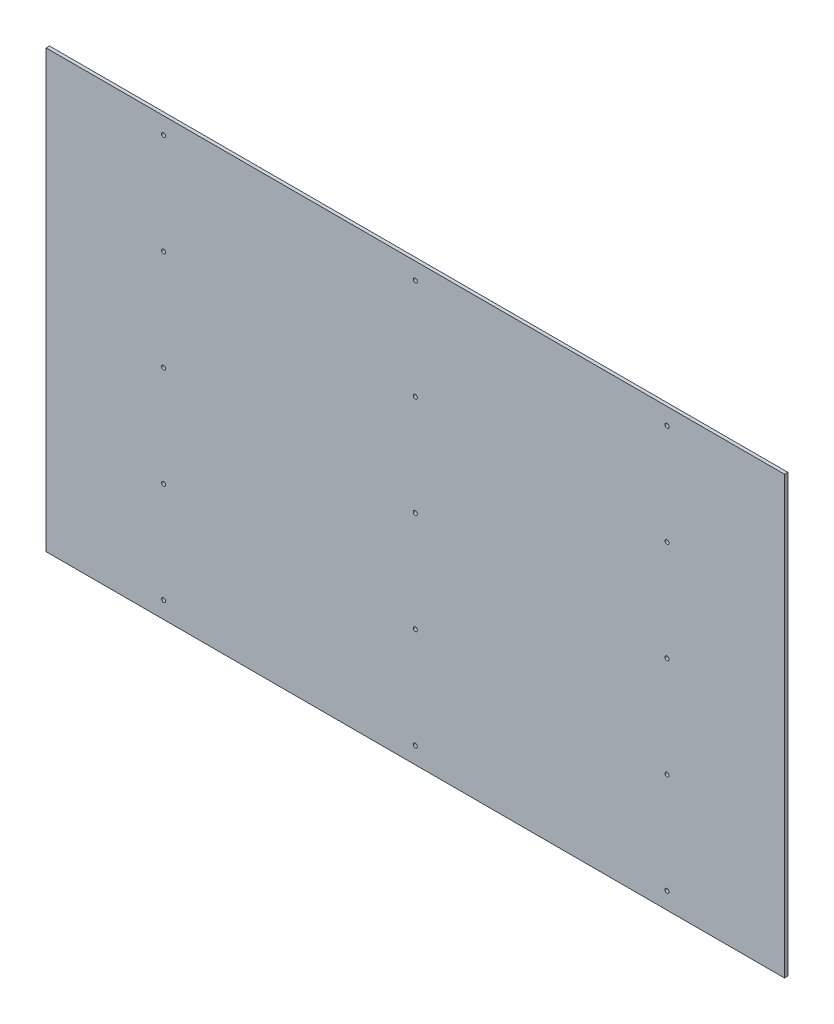
ISO-10303-21;
HEADER;
FILE_DESCRIPTION(('STEP AP214'),'2;1');
FILE_NAME('part.step','',(''),(''),'','','');
FILE_SCHEMA(('AUTOMOTIVE_DESIGN { 1 0 10303 214 1 1 1 1 }'));
ENDSEC;
DATA;
#1=APPLICATION_CONTEXT('core data for automotive mechanical design processes');
#2=APPLICATION_PROTOCOL_DEFINITION('international standard','automotive_design',2000,#1);
#3=PRODUCT_CONTEXT('',#1,'mechanical');
#4=PRODUCT('Part','Part','',(#3));
#5=PRODUCT_RELATED_PRODUCT_CATEGORY('part','',(#4));
#6=PRODUCT_DEFINITION_FORMATION('','',#4);
#7=PRODUCT_DEFINITION_CONTEXT('part definition',#1,'design');
#8=PRODUCT_DEFINITION('design','',#6,#7);
#9=PRODUCT_DEFINITION_SHAPE('','',#8);
#10=(LENGTH_UNIT() NAMED_UNIT(*) SI_UNIT(.MILLI.,.METRE.));
#11=(NAMED_UNIT(*) PLANE_ANGLE_UNIT() SI_UNIT($,.RADIAN.));
#12=(NAMED_UNIT(*) SI_UNIT($,.STERADIAN.) SOLID_ANGLE_UNIT());
#13=UNCERTAINTY_MEASURE_WITH_UNIT(LENGTH_MEASURE(1.E-05),#10,'distance_accuracy_value','');
#14=(GEOMETRIC_REPRESENTATION_CONTEXT(3) GLOBAL_UNCERTAINTY_ASSIGNED_CONTEXT((#13)) GLOBAL_UNIT_ASSIGNED_CONTEXT((#10,
#11,#12)) REPRESENTATION_CONTEXT('',''));
#15=CARTESIAN_POINT('',(0.,0.,0.));
#16=DIRECTION('',(0.,0.,1.));
#17=DIRECTION('',(1.,0.,0.));
#18=AXIS2_PLACEMENT_3D('',#15,#16,#17);
#19=CARTESIAN_POINT('',(750.,600.,10.));
#20=DIRECTION('',(0.,0.,1.));
#21=DIRECTION('',(1.,0.,0.));
#22=AXIS2_PLACEMENT_3D('',#19,#20,#21);
#23=CYLINDRICAL_SURFACE('',#22,6.00000000000001);
#24=CARTESIAN_POINT('',(750.,600.,0.));
#25=DIRECTION('',(0.,0.,1.));
#26=DIRECTION('',(1.,0.,0.));
#27=AXIS2_PLACEMENT_3D('',#24,#25,#26);
#28=CIRCLE('',#27,6.00000000000001);
#29=CARTESIAN_POINT('',(756.,600.,0.));
#30=VERTEX_POINT('',#29);
#31=EDGE_CURVE('E45',#30,#30,#28,.T.);
#32=ORIENTED_EDGE('',*,*,#31,.F.);
#33=EDGE_LOOP('',(#32));
#34=FACE_BOUND('',#33,.T.);
#35=CARTESIAN_POINT('',(750.,600.,10.));
#36=DIRECTION('',(0.,0.,1.));
#37=DIRECTION('',(1.,0.,0.));
#38=AXIS2_PLACEMENT_3D('',#35,#36,#37);
#39=CIRCLE('',#38,6.00000000000001);
#40=CARTESIAN_POINT('',(756.,600.,10.));
#41=VERTEX_POINT('',#40);
#42=EDGE_CURVE('E11',#41,#41,#39,.T.);
#43=ORIENTED_EDGE('',*,*,#42,.T.);
#44=EDGE_LOOP('',(#43));
#45=FACE_BOUND('',#44,.T.);
#46=ADVANCED_FACE('F37',(#34,#45),#23,.F.);
#47=CARTESIAN_POINT('',(750.,300.,10.));
#48=DIRECTION('',(0.,0.,1.));
#49=DIRECTION('',(1.,0.,0.));
#50=AXIS2_PLACEMENT_3D('',#47,#48,#49);
#51=CYLINDRICAL_SURFACE('',#50,6.00000000000001);
#52=CARTESIAN_POINT('',(750.,300.,0.));
#53=DIRECTION('',(0.,0.,1.));
#54=DIRECTION('',(1.,0.,0.));
#55=AXIS2_PLACEMENT_3D('',#52,#53,#54);
#56=CIRCLE('',#55,6.00000000000001);
#57=CARTESIAN_POINT('',(756.,300.,0.));
#58=VERTEX_POINT('',#57);
#59=EDGE_CURVE('E175',#58,#58,#56,.T.);
#60=ORIENTED_EDGE('',*,*,#59,.F.);
#61=EDGE_LOOP('',(#60));
#62=FACE_BOUND('',#61,.T.);
#63=CARTESIAN_POINT('',(750.,300.,10.));
#64=DIRECTION('',(0.,0.,1.));
#65=DIRECTION('',(1.,0.,0.));
#66=AXIS2_PLACEMENT_3D('',#63,#64,#65);
#67=CIRCLE('',#66,6.00000000000001);
#68=CARTESIAN_POINT('',(756.,300.,10.));
#69=VERTEX_POINT('',#68);
#70=EDGE_CURVE('E178',#69,#69,#67,.T.);
#71=ORIENTED_EDGE('',*,*,#70,.T.);
#72=EDGE_LOOP('',(#71));
#73=FACE_BOUND('',#72,.T.);
#74=ADVANCED_FACE('F187',(#62,#73),#51,.F.);
#75=CARTESIAN_POINT('',(750.,0.,10.));
#76=DIRECTION('',(0.,0.,1.));
#77=DIRECTION('',(1.,0.,0.));
#78=AXIS2_PLACEMENT_3D('',#75,#76,#77);
#79=CYLINDRICAL_SURFACE('',#78,6.00000000000001);
#80=CARTESIAN_POINT('',(750.,0.,0.));
#81=DIRECTION('',(0.,0.,1.));
#82=DIRECTION('',(1.,0.,0.));
#83=AXIS2_PLACEMENT_3D('',#80,#81,#82);
#84=CIRCLE('',#83,6.00000000000001);
#85=CARTESIAN_POINT('',(756.,0.,0.));
#86=VERTEX_POINT('',#85);
#87=EDGE_CURVE('E169',#86,#86,#84,.T.);
#88=ORIENTED_EDGE('',*,*,#87,.F.);
#89=EDGE_LOOP('',(#88));
#90=FACE_BOUND('',#89,.T.);
#91=CARTESIAN_POINT('',(750.,0.,10.));
#92=DIRECTION('',(0.,0.,1.));
#93=DIRECTION('',(1.,0.,0.));
#94=AXIS2_PLACEMENT_3D('',#91,#92,#93);
#95=CIRCLE('',#94,6.00000000000001);
#96=CARTESIAN_POINT('',(756.,0.,10.));
#97=VERTEX_POINT('',#96);
#98=EDGE_CURVE('E172',#97,#97,#95,.T.);
#99=ORIENTED_EDGE('',*,*,#98,.T.);
#100=EDGE_LOOP('',(#99));
#101=FACE_BOUND('',#100,.T.);
#102=ADVANCED_FACE('F250',(#90,#101),#79,.F.);
#103=CARTESIAN_POINT('',(750.,-300.,10.));
#104=DIRECTION('',(0.,0.,1.));
#105=DIRECTION('',(1.,0.,0.));
#106=AXIS2_PLACEMENT_3D('',#103,#104,#105);
#107=CYLINDRICAL_SURFACE('',#106,6.00000000000001);
#108=CARTESIAN_POINT('',(750.,-300.,0.));
#109=DIRECTION('',(0.,0.,1.));
#110=DIRECTION('',(1.,0.,0.));
#111=AXIS2_PLACEMENT_3D('',#108,#109,#110);
#112=CIRCLE('',#111,6.00000000000001);
#113=CARTESIAN_POINT('',(756.,-300.,0.));
#114=VERTEX_POINT('',#113);
#115=EDGE_CURVE('E163',#114,#114,#112,.T.);
#116=ORIENTED_EDGE('',*,*,#115,.F.);
#117=EDGE_LOOP('',(#116));
#118=FACE_BOUND('',#117,.T.);
#119=CARTESIAN_POINT('',(750.,-300.,10.));
#120=DIRECTION('',(0.,0.,1.));
#121=DIRECTION('',(1.,0.,0.));
#122=AXIS2_PLACEMENT_3D('',#119,#120,#121);
#123=CIRCLE('',#122,6.00000000000001);
#124=CARTESIAN_POINT('',(756.,-300.,10.));
#125=VERTEX_POINT('',#124);
#126=EDGE_CURVE('E166',#125,#125,#123,.T.);
#127=ORIENTED_EDGE('',*,*,#126,.T.);
#128=EDGE_LOOP('',(#127));
#129=FACE_BOUND('',#128,.T.);
#130=ADVANCED_FACE('F246',(#118,#129),#107,.F.);
#131=CARTESIAN_POINT('',(750.,-600.,10.));
#132=DIRECTION('',(0.,0.,1.));
#133=DIRECTION('',(1.,0.,0.));
#134=AXIS2_PLACEMENT_3D('',#131,#132,#133);
#135=CYLINDRICAL_SURFACE('',#134,6.00000000000001);
#136=CARTESIAN_POINT('',(750.,-600.,0.));
#137=DIRECTION('',(0.,0.,1.));
#138=DIRECTION('',(1.,0.,0.));
#139=AXIS2_PLACEMENT_3D('',#136,#137,#138);
#140=CIRCLE('',#139,6.00000000000001);
#141=CARTESIAN_POINT('',(756.,-600.,0.));
#142=VERTEX_POINT('',#141);
#143=EDGE_CURVE('E157',#142,#142,#140,.T.);
#144=ORIENTED_EDGE('',*,*,#143,.F.);
#145=EDGE_LOOP('',(#144));
#146=FACE_BOUND('',#145,.T.);
#147=CARTESIAN_POINT('',(750.,-600.,10.));
#148=DIRECTION('',(0.,0.,1.));
#149=DIRECTION('',(1.,0.,0.));
#150=AXIS2_PLACEMENT_3D('',#147,#148,#149);
#151=CIRCLE('',#150,6.00000000000001);
#152=CARTESIAN_POINT('',(756.,-600.,10.));
#153=VERTEX_POINT('',#152);
#154=EDGE_CURVE('E160',#153,#153,#151,.T.);
#155=ORIENTED_EDGE('',*,*,#154,.T.);
#156=EDGE_LOOP('',(#155));
#157=FACE_BOUND('',#156,.T.);
#158=ADVANCED_FACE('F242',(#146,#157),#135,.F.);
#159=CARTESIAN_POINT('',(0.,600.,10.));
#160=DIRECTION('',(0.,0.,1.));
#161=DIRECTION('',(1.,0.,0.));
#162=AXIS2_PLACEMENT_3D('',#159,#160,#161);
#163=CYLINDRICAL_SURFACE('',#162,6.00000000000001);
#164=CARTESIAN_POINT('',(0.,600.,0.));
#165=DIRECTION('',(0.,0.,1.));
#166=DIRECTION('',(1.,0.,0.));
#167=AXIS2_PLACEMENT_3D('',#164,#165,#166);
#168=CIRCLE('',#167,6.00000000000001);
#169=CARTESIAN_POINT('',(6.00000000000001,600.,0.));
#170=VERTEX_POINT('',#169);
#171=EDGE_CURVE('E151',#170,#170,#168,.T.);
#172=ORIENTED_EDGE('',*,*,#171,.F.);
#173=EDGE_LOOP('',(#172));
#174=FACE_BOUND('',#173,.T.);
#175=CARTESIAN_POINT('',(0.,600.,10.));
#176=DIRECTION('',(0.,0.,1.));
#177=DIRECTION('',(1.,0.,0.));
#178=AXIS2_PLACEMENT_3D('',#175,#176,#177);
#179=CIRCLE('',#178,6.00000000000001);
#180=CARTESIAN_POINT('',(6.00000000000001,600.,10.));
#181=VERTEX_POINT('',#180);
#182=EDGE_CURVE('E154',#181,#181,#179,.T.);
#183=ORIENTED_EDGE('',*,*,#182,.T.);
#184=EDGE_LOOP('',(#183));
#185=FACE_BOUND('',#184,.T.);
#186=ADVANCED_FACE('F238',(#174,#185),#163,.F.);
#187=CARTESIAN_POINT('',(0.,-600.,10.));
#188=DIRECTION('',(0.,0.,1.));
#189=DIRECTION('',(1.,0.,0.));
#190=AXIS2_PLACEMENT_3D('',#187,#188,#189);
#191=CYLINDRICAL_SURFACE('',#190,6.00000000000001);
#192=CARTESIAN_POINT('',(0.,-600.,0.));
#193=DIRECTION('',(0.,0.,1.));
#194=DIRECTION('',(1.,0.,0.));
#195=AXIS2_PLACEMENT_3D('',#192,#193,#194);
#196=CIRCLE('',#195,6.00000000000001);
#197=CARTESIAN_POINT('',(6.00000000000001,-600.,0.));
#198=VERTEX_POINT('',#197);
#199=EDGE_CURVE('E145',#198,#198,#196,.T.);
#200=ORIENTED_EDGE('',*,*,#199,.F.);
#201=EDGE_LOOP('',(#200));
#202=FACE_BOUND('',#201,.T.);
#203=CARTESIAN_POINT('',(0.,-600.,10.));
#204=DIRECTION('',(0.,0.,1.));
#205=DIRECTION('',(1.,0.,0.));
#206=AXIS2_PLACEMENT_3D('',#203,#204,#205);
#207=CIRCLE('',#206,6.00000000000001);
#208=CARTESIAN_POINT('',(6.00000000000001,-600.,10.));
#209=VERTEX_POINT('',#208);
#210=EDGE_CURVE('E148',#209,#209,#207,.T.);
#211=ORIENTED_EDGE('',*,*,#210,.T.);
#212=EDGE_LOOP('',(#211));
#213=FACE_BOUND('',#212,.T.);
#214=ADVANCED_FACE('F234',(#202,#213),#191,.F.);
#215=CARTESIAN_POINT('',(-750.,600.,10.));
#216=DIRECTION('',(0.,0.,1.));
#217=DIRECTION('',(1.,0.,0.));
#218=AXIS2_PLACEMENT_3D('',#215,#216,#217);
#219=CYLINDRICAL_SURFACE('',#218,6.00000000000001);
#220=CARTESIAN_POINT('',(-750.,600.,0.));
#221=DIRECTION('',(0.,0.,1.));
#222=DIRECTION('',(1.,0.,0.));
#223=AXIS2_PLACEMENT_3D('',#220,#221,#222);
#224=CIRCLE('',#223,6.00000000000001);
#225=CARTESIAN_POINT('',(-744.,600.,0.));
#226=VERTEX_POINT('',#225);
#227=EDGE_CURVE('E139',#226,#226,#224,.T.);
#228=ORIENTED_EDGE('',*,*,#227,.F.);
#229=EDGE_LOOP('',(#228));
#230=FACE_BOUND('',#229,.T.);
#231=CARTESIAN_POINT('',(-750.,600.,10.));
#232=DIRECTION('',(0.,0.,1.));
#233=DIRECTION('',(1.,0.,0.));
#234=AXIS2_PLACEMENT_3D('',#231,#232,#233);
#235=CIRCLE('',#234,6.00000000000001);
#236=CARTESIAN_POINT('',(-744.,600.,10.));
#237=VERTEX_POINT('',#236);
#238=EDGE_CURVE('E142',#237,#237,#235,.T.);
#239=ORIENTED_EDGE('',*,*,#238,.T.);
#240=EDGE_LOOP('',(#239));
#241=FACE_BOUND('',#240,.T.);
#242=ADVANCED_FACE('F230',(#230,#241),#219,.F.);
#243=CARTESIAN_POINT('',(-750.,300.,10.));
#244=DIRECTION('',(0.,0.,1.));
#245=DIRECTION('',(1.,0.,0.));
#246=AXIS2_PLACEMENT_3D('',#243,#244,#245);
#247=CYLINDRICAL_SURFACE('',#246,6.00000000000001);
#248=CARTESIAN_POINT('',(-750.,300.,0.));
#249=DIRECTION('',(0.,0.,1.));
#250=DIRECTION('',(1.,0.,0.));
#251=AXIS2_PLACEMENT_3D('',#248,#249,#250);
#252=CIRCLE('',#251,6.00000000000001);
#253=CARTESIAN_POINT('',(-744.,300.,0.));
#254=VERTEX_POINT('',#253);
#255=EDGE_CURVE('E133',#254,#254,#252,.T.);
#256=ORIENTED_EDGE('',*,*,#255,.F.);
#257=EDGE_LOOP('',(#256));
#258=FACE_BOUND('',#257,.T.);
#259=CARTESIAN_POINT('',(-750.,300.,10.));
#260=DIRECTION('',(0.,0.,1.));
#261=DIRECTION('',(1.,0.,0.));
#262=AXIS2_PLACEMENT_3D('',#259,#260,#261);
#263=CIRCLE('',#262,6.00000000000001);
#264=CARTESIAN_POINT('',(-744.,300.,10.));
#265=VERTEX_POINT('',#264);
#266=EDGE_CURVE('E136',#265,#265,#263,.T.);
#267=ORIENTED_EDGE('',*,*,#266,.T.);
#268=EDGE_LOOP('',(#267));
#269=FACE_BOUND('',#268,.T.);
#270=ADVANCED_FACE('F226',(#258,#269),#247,.F.);
#271=CARTESIAN_POINT('',(-750.,0.,10.));
#272=DIRECTION('',(0.,0.,1.));
#273=DIRECTION('',(1.,0.,0.));
#274=AXIS2_PLACEMENT_3D('',#271,#272,#273);
#275=CYLINDRICAL_SURFACE('',#274,6.00000000000001);
#276=CARTESIAN_POINT('',(-750.,0.,0.));
#277=DIRECTION('',(0.,0.,1.));
#278=DIRECTION('',(1.,0.,0.));
#279=AXIS2_PLACEMENT_3D('',#276,#277,#278);
#280=CIRCLE('',#279,6.00000000000001);
#281=CARTESIAN_POINT('',(-744.,0.,0.));
#282=VERTEX_POINT('',#281);
#283=EDGE_CURVE('E127',#282,#282,#280,.T.);
#284=ORIENTED_EDGE('',*,*,#283,.F.);
#285=EDGE_LOOP('',(#284));
#286=FACE_BOUND('',#285,.T.);
#287=CARTESIAN_POINT('',(-750.,0.,10.));
#288=DIRECTION('',(0.,0.,1.));
#289=DIRECTION('',(1.,0.,0.));
#290=AXIS2_PLACEMENT_3D('',#287,#288,#289);
#291=CIRCLE('',#290,6.00000000000001);
#292=CARTESIAN_POINT('',(-744.,0.,10.));
#293=VERTEX_POINT('',#292);
#294=EDGE_CURVE('E130',#293,#293,#291,.T.);
#295=ORIENTED_EDGE('',*,*,#294,.T.);
#296=EDGE_LOOP('',(#295));
#297=FACE_BOUND('',#296,.T.);
#298=ADVANCED_FACE('F222',(#286,#297),#275,.F.);
#299=CARTESIAN_POINT('',(0.,300.,10.));
#300=DIRECTION('',(0.,0.,1.));
#301=DIRECTION('',(1.,0.,0.));
#302=AXIS2_PLACEMENT_3D('',#299,#300,#301);
#303=CYLINDRICAL_SURFACE('',#302,6.00000000000001);
#304=CARTESIAN_POINT('',(0.,300.,0.));
#305=DIRECTION('',(0.,0.,1.));
#306=DIRECTION('',(1.,0.,0.));
#307=AXIS2_PLACEMENT_3D('',#304,#305,#306);
#308=CIRCLE('',#307,6.00000000000001);
#309=CARTESIAN_POINT('',(6.00000000000001,300.,0.));
#310=VERTEX_POINT('',#309);
#311=EDGE_CURVE('E121',#310,#310,#308,.T.);
#312=ORIENTED_EDGE('',*,*,#311,.F.);
#313=EDGE_LOOP('',(#312));
#314=FACE_BOUND('',#313,.T.);
#315=CARTESIAN_POINT('',(0.,300.,10.));
#316=DIRECTION('',(0.,0.,1.));
#317=DIRECTION('',(1.,0.,0.));
#318=AXIS2_PLACEMENT_3D('',#315,#316,#317);
#319=CIRCLE('',#318,6.00000000000001);
#320=CARTESIAN_POINT('',(6.00000000000001,300.,10.));
#321=VERTEX_POINT('',#320);
#322=EDGE_CURVE('E124',#321,#321,#319,.T.);
#323=ORIENTED_EDGE('',*,*,#322,.T.);
#324=EDGE_LOOP('',(#323));
#325=FACE_BOUND('',#324,.T.);
#326=ADVANCED_FACE('F218',(#314,#325),#303,.F.);
#327=CARTESIAN_POINT('',(0.,0.,10.));
#328=DIRECTION('',(0.,0.,1.));
#329=DIRECTION('',(1.,0.,0.));
#330=AXIS2_PLACEMENT_3D('',#327,#328,#329);
#331=CYLINDRICAL_SURFACE('',#330,6.00000000000001);
#332=CARTESIAN_POINT('',(0.,0.,0.));
#333=DIRECTION('',(0.,0.,1.));
#334=DIRECTION('',(1.,0.,0.));
#335=AXIS2_PLACEMENT_3D('',#332,#333,#334);
#336=CIRCLE('',#335,6.00000000000001);
#337=CARTESIAN_POINT('',(6.00000000000001,0.,0.));
#338=VERTEX_POINT('',#337);
#339=EDGE_CURVE('E115',#338,#338,#336,.T.);
#340=ORIENTED_EDGE('',*,*,#339,.F.);
#341=EDGE_LOOP('',(#340));
#342=FACE_BOUND('',#341,.T.);
#343=CARTESIAN_POINT('',(0.,0.,10.));
#344=DIRECTION('',(0.,0.,1.));
#345=DIRECTION('',(1.,0.,0.));
#346=AXIS2_PLACEMENT_3D('',#343,#344,#345);
#347=CIRCLE('',#346,6.00000000000001);
#348=CARTESIAN_POINT('',(6.00000000000001,0.,10.));
#349=VERTEX_POINT('',#348);
#350=EDGE_CURVE('E118',#349,#349,#347,.T.);
#351=ORIENTED_EDGE('',*,*,#350,.T.);
#352=EDGE_LOOP('',(#351));
#353=FACE_BOUND('',#352,.T.);
#354=ADVANCED_FACE('F214',(#342,#353),#331,.F.);
#355=CARTESIAN_POINT('',(1100.,-650.,10.));
#356=DIRECTION('',(-1.,0.,0.));
#357=DIRECTION('',(0.,0.,1.));
#358=AXIS2_PLACEMENT_3D('',#355,#356,#357);
#359=PLANE('',#358);
#360=DIRECTION('',(0.,1.,0.));
#361=VECTOR('',#360,1.);
#362=CARTESIAN_POINT('',(1100.,-650.,0.));
#363=LINE('',#362,#361);
#364=CARTESIAN_POINT('',(1100.,-650.,0.));
#365=VERTEX_POINT('',#364);
#366=CARTESIAN_POINT('',(1100.,650.,0.));
#367=VERTEX_POINT('',#366);
#368=EDGE_CURVE('E105',#365,#367,#363,.T.);
#369=ORIENTED_EDGE('',*,*,#368,.T.);
#370=DIRECTION('',(0.,0.,-1.));
#371=VECTOR('',#370,1.);
#372=CARTESIAN_POINT('',(1100.,650.,10.));
#373=LINE('',#372,#371);
#374=CARTESIAN_POINT('',(1100.,650.,10.));
#375=VERTEX_POINT('',#374);
#376=EDGE_CURVE('E96',#375,#367,#373,.T.);
#377=ORIENTED_EDGE('',*,*,#376,.F.);
#378=DIRECTION('',(0.,1.,0.));
#379=VECTOR('',#378,1.);
#380=CARTESIAN_POINT('',(1100.,-650.,10.));
#381=LINE('',#380,#379);
#382=CARTESIAN_POINT('',(1100.,-650.,10.));
#383=VERTEX_POINT('',#382);
#384=EDGE_CURVE('E90',#383,#375,#381,.T.);
#385=ORIENTED_EDGE('',*,*,#384,.F.);
#386=DIRECTION('',(0.,0.,-1.));
#387=VECTOR('',#386,1.);
#388=CARTESIAN_POINT('',(1100.,-650.,10.));
#389=LINE('',#388,#387);
#390=EDGE_CURVE('E101',#383,#365,#389,.T.);
#391=ORIENTED_EDGE('',*,*,#390,.T.);
#392=EDGE_LOOP('',(#369,#377,#385,#391));
#393=FACE_BOUND('',#392,.T.);
#394=ADVANCED_FACE('F211',(#393),#359,.F.);
#395=CARTESIAN_POINT('',(-1100.,650.,10.));
#396=DIRECTION('',(0.,-1.,0.));
#397=DIRECTION('',(0.,0.,-1.));
#398=AXIS2_PLACEMENT_3D('',#395,#396,#397);
#399=PLANE('',#398);
#400=DIRECTION('',(-1.,0.,0.));
#401=VECTOR('',#400,1.);
#402=CARTESIAN_POINT('',(-1100.,650.,0.));
#403=LINE('',#402,#401);
#404=CARTESIAN_POINT('',(-1100.,650.,0.));
#405=VERTEX_POINT('',#404);
#406=EDGE_CURVE('E95',#367,#405,#403,.T.);
#407=ORIENTED_EDGE('',*,*,#406,.T.);
#408=DIRECTION('',(0.,0.,-1.));
#409=VECTOR('',#408,1.);
#410=CARTESIAN_POINT('',(-1100.,650.,10.));
#411=LINE('',#410,#409);
#412=CARTESIAN_POINT('',(-1100.,650.,10.));
#413=VERTEX_POINT('',#412);
#414=EDGE_CURVE('E93',#413,#405,#411,.T.);
#415=ORIENTED_EDGE('',*,*,#414,.F.);
#416=DIRECTION('',(-1.,0.,0.));
#417=VECTOR('',#416,1.);
#418=CARTESIAN_POINT('',(-1100.,650.,10.));
#419=LINE('',#418,#417);
#420=EDGE_CURVE('E84',#375,#413,#419,.T.);
#421=ORIENTED_EDGE('',*,*,#420,.F.);
#422=ORIENTED_EDGE('',*,*,#376,.T.);
#423=EDGE_LOOP('',(#407,#415,#421,#422));
#424=FACE_BOUND('',#423,.T.);
#425=ADVANCED_FACE('F94',(#424),#399,.F.);
#426=CARTESIAN_POINT('',(-1100.,-650.,10.));
#427=DIRECTION('',(1.,0.,0.));
#428=DIRECTION('',(0.,0.,-1.));
#429=AXIS2_PLACEMENT_3D('',#426,#427,#428);
#430=PLANE('',#429);
#431=DIRECTION('',(0.,-1.,0.));
#432=VECTOR('',#431,1.);
#433=CARTESIAN_POINT('',(-1100.,-650.,0.));
#434=LINE('',#433,#432);
#435=CARTESIAN_POINT('',(-1100.,-650.,0.));
#436=VERTEX_POINT('',#435);
#437=EDGE_CURVE('E70',#405,#436,#434,.T.);
#438=ORIENTED_EDGE('',*,*,#437,.T.);
#439=DIRECTION('',(0.,0.,-1.));
#440=VECTOR('',#439,1.);
#441=CARTESIAN_POINT('',(-1100.,-650.,10.));
#442=LINE('',#441,#440);
#443=CARTESIAN_POINT('',(-1100.,-650.,10.));
#444=VERTEX_POINT('',#443);
#445=EDGE_CURVE('E97',#444,#436,#442,.T.);
#446=ORIENTED_EDGE('',*,*,#445,.F.);
#447=DIRECTION('',(0.,-1.,0.));
#448=VECTOR('',#447,1.);
#449=CARTESIAN_POINT('',(-1100.,-650.,10.));
#450=LINE('',#449,#448);
#451=EDGE_CURVE('E88',#413,#444,#450,.T.);
#452=ORIENTED_EDGE('',*,*,#451,.F.);
#453=ORIENTED_EDGE('',*,*,#414,.T.);
#454=EDGE_LOOP('',(#438,#446,#452,#453));
#455=FACE_BOUND('',#454,.T.);
#456=ADVANCED_FACE('F99',(#455),#430,.F.);
#457=CARTESIAN_POINT('',(-1100.,-650.,10.));
#458=DIRECTION('',(0.,1.,0.));
#459=DIRECTION('',(0.,0.,1.));
#460=AXIS2_PLACEMENT_3D('',#457,#458,#459);
#461=PLANE('',#460);
#462=DIRECTION('',(1.,0.,0.));
#463=VECTOR('',#462,1.);
#464=CARTESIAN_POINT('',(-1100.,-650.,0.));
#465=LINE('',#464,#463);
#466=EDGE_CURVE('E76',#436,#365,#465,.T.);
#467=ORIENTED_EDGE('',*,*,#466,.T.);
#468=ORIENTED_EDGE('',*,*,#390,.F.);
#469=DIRECTION('',(1.,0.,0.));
#470=VECTOR('',#469,1.);
#471=CARTESIAN_POINT('',(-1100.,-650.,10.));
#472=LINE('',#471,#470);
#473=EDGE_CURVE('E53',#444,#383,#472,.T.);
#474=ORIENTED_EDGE('',*,*,#473,.F.);
#475=ORIENTED_EDGE('',*,*,#445,.T.);
#476=EDGE_LOOP('',(#467,#468,#474,#475));
#477=FACE_BOUND('',#476,.T.);
#478=ADVANCED_FACE('F191',(#477),#461,.F.);
#479=CARTESIAN_POINT('',(0.,0.,10.));
#480=DIRECTION('',(0.,0.,-1.));
#481=DIRECTION('',(-1.,0.,0.));
#482=AXIS2_PLACEMENT_3D('',#479,#480,#481);
#483=PLANE('',#482);
#484=CARTESIAN_POINT('',(-750.,-300.,10.));
#485=DIRECTION('',(0.,0.,1.));
#486=DIRECTION('',(1.,0.,0.));
#487=AXIS2_PLACEMENT_3D('',#484,#485,#486);
#488=CIRCLE('',#487,6.00000000000001);
#489=CARTESIAN_POINT('',(-744.,-300.,10.));
#490=VERTEX_POINT('',#489);
#491=EDGE_CURVE('E387',#490,#490,#488,.T.);
#492=ORIENTED_EDGE('',*,*,#491,.F.);
#493=EDGE_LOOP('',(#492));
#494=FACE_BOUND('',#493,.T.);
#495=CARTESIAN_POINT('',(0.,-300.,10.));
#496=DIRECTION('',(0.,0.,1.));
#497=DIRECTION('',(1.,0.,0.));
#498=AXIS2_PLACEMENT_3D('',#495,#496,#497);
#499=CIRCLE('',#498,6.00000000000001);
#500=CARTESIAN_POINT('',(6.00000000000001,-300.,10.));
#501=VERTEX_POINT('',#500);
#502=EDGE_CURVE('E391',#501,#501,#499,.T.);
#503=ORIENTED_EDGE('',*,*,#502,.F.);
#504=EDGE_LOOP('',(#503));
#505=FACE_BOUND('',#504,.T.);
#506=CARTESIAN_POINT('',(-750.,-600.,10.));
#507=DIRECTION('',(0.,0.,1.));
#508=DIRECTION('',(1.,0.,0.));
#509=AXIS2_PLACEMENT_3D('',#506,#507,#508);
#510=CIRCLE('',#509,6.00000000000001);
#511=CARTESIAN_POINT('',(-744.,-600.,10.));
#512=VERTEX_POINT('',#511);
#513=EDGE_CURVE('E397',#512,#512,#510,.T.);
#514=ORIENTED_EDGE('',*,*,#513,.F.);
#515=EDGE_LOOP('',(#514));
#516=FACE_BOUND('',#515,.T.);
#517=ORIENTED_EDGE('',*,*,#384,.T.);
#518=ORIENTED_EDGE('',*,*,#420,.T.);
#519=ORIENTED_EDGE('',*,*,#451,.T.);
#520=ORIENTED_EDGE('',*,*,#473,.T.);
#521=EDGE_LOOP('',(#517,#518,#519,#520));
#522=FACE_BOUND('',#521,.T.);
#523=ORIENTED_EDGE('',*,*,#350,.F.);
#524=EDGE_LOOP('',(#523));
#525=FACE_BOUND('',#524,.T.);
#526=ORIENTED_EDGE('',*,*,#322,.F.);
#527=EDGE_LOOP('',(#526));
#528=FACE_BOUND('',#527,.T.);
#529=ORIENTED_EDGE('',*,*,#294,.F.);
#530=EDGE_LOOP('',(#529));
#531=FACE_BOUND('',#530,.T.);
#532=ORIENTED_EDGE('',*,*,#266,.F.);
#533=EDGE_LOOP('',(#532));
#534=FACE_BOUND('',#533,.T.);
#535=ORIENTED_EDGE('',*,*,#238,.F.);
#536=EDGE_LOOP('',(#535));
#537=FACE_BOUND('',#536,.T.);
#538=ORIENTED_EDGE('',*,*,#210,.F.);
#539=EDGE_LOOP('',(#538));
#540=FACE_BOUND('',#539,.T.);
#541=ORIENTED_EDGE('',*,*,#182,.F.);
#542=EDGE_LOOP('',(#541));
#543=FACE_BOUND('',#542,.T.);
#544=ORIENTED_EDGE('',*,*,#154,.F.);
#545=EDGE_LOOP('',(#544));
#546=FACE_BOUND('',#545,.T.);
#547=ORIENTED_EDGE('',*,*,#126,.F.);
#548=EDGE_LOOP('',(#547));
#549=FACE_BOUND('',#548,.T.);
#550=ORIENTED_EDGE('',*,*,#98,.F.);
#551=EDGE_LOOP('',(#550));
#552=FACE_BOUND('',#551,.T.);
#553=ORIENTED_EDGE('',*,*,#70,.F.);
#554=EDGE_LOOP('',(#553));
#555=FACE_BOUND('',#554,.T.);
#556=ORIENTED_EDGE('',*,*,#42,.F.);
#557=EDGE_LOOP('',(#556));
#558=FACE_BOUND('',#557,.T.);
#559=ADVANCED_FACE('F85',(#494,#505,#516,#522,#525,#528,#531,#534,#537,#540,#543,#546,#549,#552,
#555,#558),#483,.F.);
#560=CARTESIAN_POINT('',(0.,0.,0.));
#561=DIRECTION('',(0.,0.,-1.));
#562=DIRECTION('',(-1.,0.,0.));
#563=AXIS2_PLACEMENT_3D('',#560,#561,#562);
#564=PLANE('',#563);
#565=CARTESIAN_POINT('',(-750.,-300.,0.));
#566=DIRECTION('',(0.,0.,1.));
#567=DIRECTION('',(1.,0.,0.));
#568=AXIS2_PLACEMENT_3D('',#565,#566,#567);
#569=CIRCLE('',#568,6.00000000000001);
#570=CARTESIAN_POINT('',(-744.,-300.,0.));
#571=VERTEX_POINT('',#570);
#572=EDGE_CURVE('E385',#571,#571,#569,.T.);
#573=ORIENTED_EDGE('',*,*,#572,.T.);
#574=EDGE_LOOP('',(#573));
#575=FACE_BOUND('',#574,.T.);
#576=CARTESIAN_POINT('',(0.,-300.,0.));
#577=DIRECTION('',(0.,0.,1.));
#578=DIRECTION('',(1.,0.,0.));
#579=AXIS2_PLACEMENT_3D('',#576,#577,#578);
#580=CIRCLE('',#579,6.00000000000001);
#581=CARTESIAN_POINT('',(6.00000000000001,-300.,0.));
#582=VERTEX_POINT('',#581);
#583=EDGE_CURVE('E388',#582,#582,#580,.T.);
#584=ORIENTED_EDGE('',*,*,#583,.T.);
#585=EDGE_LOOP('',(#584));
#586=FACE_BOUND('',#585,.T.);
#587=CARTESIAN_POINT('',(-750.,-600.,0.));
#588=DIRECTION('',(0.,0.,1.));
#589=DIRECTION('',(1.,0.,0.));
#590=AXIS2_PLACEMENT_3D('',#587,#588,#589);
#591=CIRCLE('',#590,6.00000000000001);
#592=CARTESIAN_POINT('',(-744.,-600.,0.));
#593=VERTEX_POINT('',#592);
#594=EDGE_CURVE('E108',#593,#593,#591,.T.);
#595=ORIENTED_EDGE('',*,*,#594,.T.);
#596=EDGE_LOOP('',(#595));
#597=FACE_BOUND('',#596,.T.);
#598=ORIENTED_EDGE('',*,*,#368,.F.);
#599=ORIENTED_EDGE('',*,*,#466,.F.);
#600=ORIENTED_EDGE('',*,*,#437,.F.);
#601=ORIENTED_EDGE('',*,*,#406,.F.);
#602=EDGE_LOOP('',(#598,#599,#600,#601));
#603=FACE_BOUND('',#602,.T.);
#604=ORIENTED_EDGE('',*,*,#339,.T.);
#605=EDGE_LOOP('',(#604));
#606=FACE_BOUND('',#605,.T.);
#607=ORIENTED_EDGE('',*,*,#311,.T.);
#608=EDGE_LOOP('',(#607));
#609=FACE_BOUND('',#608,.T.);
#610=ORIENTED_EDGE('',*,*,#283,.T.);
#611=EDGE_LOOP('',(#610));
#612=FACE_BOUND('',#611,.T.);
#613=ORIENTED_EDGE('',*,*,#255,.T.);
#614=EDGE_LOOP('',(#613));
#615=FACE_BOUND('',#614,.T.);
#616=ORIENTED_EDGE('',*,*,#227,.T.);
#617=EDGE_LOOP('',(#616));
#618=FACE_BOUND('',#617,.T.);
#619=ORIENTED_EDGE('',*,*,#199,.T.);
#620=EDGE_LOOP('',(#619));
#621=FACE_BOUND('',#620,.T.);
#622=ORIENTED_EDGE('',*,*,#171,.T.);
#623=EDGE_LOOP('',(#622));
#624=FACE_BOUND('',#623,.T.);
#625=ORIENTED_EDGE('',*,*,#143,.T.);
#626=EDGE_LOOP('',(#625));
#627=FACE_BOUND('',#626,.T.);
#628=ORIENTED_EDGE('',*,*,#115,.T.);
#629=EDGE_LOOP('',(#628));
#630=FACE_BOUND('',#629,.T.);
#631=ORIENTED_EDGE('',*,*,#87,.T.);
#632=EDGE_LOOP('',(#631));
#633=FACE_BOUND('',#632,.T.);
#634=ORIENTED_EDGE('',*,*,#59,.T.);
#635=EDGE_LOOP('',(#634));
#636=FACE_BOUND('',#635,.T.);
#637=ORIENTED_EDGE('',*,*,#31,.T.);
#638=EDGE_LOOP('',(#637));
#639=FACE_BOUND('',#638,.T.);
#640=ADVANCED_FACE('F183',(#575,#586,#597,#603,#606,#609,#612,#615,#618,#621,#624,#627,#630,
#633,#636,#639),#564,.T.);
#641=CARTESIAN_POINT('',(-750.,-600.,10.));
#642=DIRECTION('',(0.,0.,1.));
#643=DIRECTION('',(1.,0.,0.));
#644=AXIS2_PLACEMENT_3D('',#641,#642,#643);
#645=CYLINDRICAL_SURFACE('',#644,6.00000000000001);
#646=ORIENTED_EDGE('',*,*,#594,.F.);
#647=EDGE_LOOP('',(#646));
#648=FACE_BOUND('',#647,.T.);
#649=ORIENTED_EDGE('',*,*,#513,.T.);
#650=EDGE_LOOP('',(#649));
#651=FACE_BOUND('',#650,.T.);
#652=ADVANCED_FACE('F198',(#648,#651),#645,.F.);
#653=CARTESIAN_POINT('',(0.,-300.,10.));
#654=DIRECTION('',(0.,0.,1.));
#655=DIRECTION('',(1.,0.,0.));
#656=AXIS2_PLACEMENT_3D('',#653,#654,#655);
#657=CYLINDRICAL_SURFACE('',#656,6.00000000000001);
#658=ORIENTED_EDGE('',*,*,#583,.F.);
#659=EDGE_LOOP('',(#658));
#660=FACE_BOUND('',#659,.T.);
#661=ORIENTED_EDGE('',*,*,#502,.T.);
#662=EDGE_LOOP('',(#661));
#663=FACE_BOUND('',#662,.T.);
#664=ADVANCED_FACE('F331',(#660,#663),#657,.F.);
#665=CARTESIAN_POINT('',(-750.,-300.,10.));
#666=DIRECTION('',(0.,0.,1.));
#667=DIRECTION('',(1.,0.,0.));
#668=AXIS2_PLACEMENT_3D('',#665,#666,#667);
#669=CYLINDRICAL_SURFACE('',#668,6.00000000000001);
#670=ORIENTED_EDGE('',*,*,#572,.F.);
#671=EDGE_LOOP('',(#670));
#672=FACE_BOUND('',#671,.T.);
#673=ORIENTED_EDGE('',*,*,#491,.T.);
#674=EDGE_LOOP('',(#673));
#675=FACE_BOUND('',#674,.T.);
#676=ADVANCED_FACE('F369',(#672,#675),#669,.F.);
#677=CLOSED_SHELL('',(#46,#74,#102,#130,#158,#186,#214,#242,#270,#298,#326,#354,#394,#425,#456,
#478,#559,#640,#652,#664,#676));
#678=MANIFOLD_SOLID_BREP('B2',#677);
#679=ADVANCED_BREP_SHAPE_REPRESENTATION('',(#18,#678),#14);
#680=SHAPE_DEFINITION_REPRESENTATION(#9,#679);
ENDSEC;
END-ISO-10303-21;
